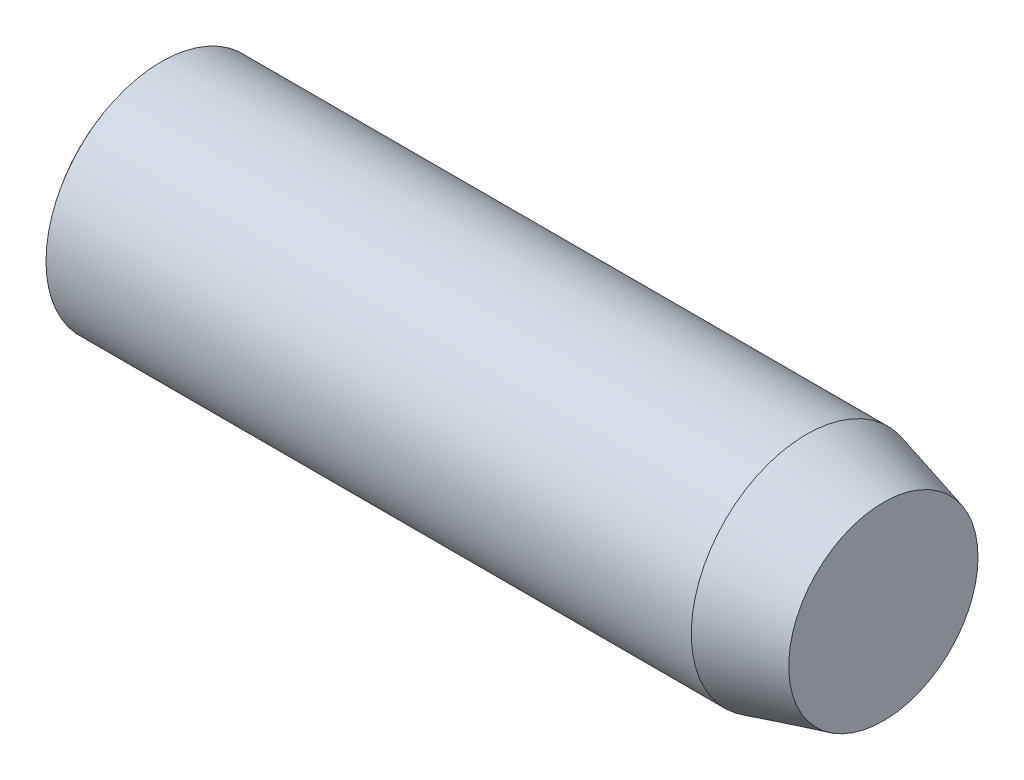
ISO-10303-21;
HEADER;
FILE_DESCRIPTION(('STEP AP214'),'2;1');
FILE_NAME('part.step','',(''),(''),'','','');
FILE_SCHEMA(('AUTOMOTIVE_DESIGN { 1 0 10303 214 1 1 1 1 }'));
ENDSEC;
DATA;
#1=APPLICATION_CONTEXT('core data for automotive mechanical design processes');
#2=APPLICATION_PROTOCOL_DEFINITION('international standard','automotive_design',2000,#1);
#3=PRODUCT_CONTEXT('',#1,'mechanical');
#4=PRODUCT('Part','Part','',(#3));
#5=PRODUCT_RELATED_PRODUCT_CATEGORY('part','',(#4));
#6=PRODUCT_DEFINITION_FORMATION('','',#4);
#7=PRODUCT_DEFINITION_CONTEXT('part definition',#1,'design');
#8=PRODUCT_DEFINITION('design','',#6,#7);
#9=PRODUCT_DEFINITION_SHAPE('','',#8);
#10=(LENGTH_UNIT() NAMED_UNIT(*) SI_UNIT(.MILLI.,.METRE.));
#11=(NAMED_UNIT(*) PLANE_ANGLE_UNIT() SI_UNIT($,.RADIAN.));
#12=(NAMED_UNIT(*) SI_UNIT($,.STERADIAN.) SOLID_ANGLE_UNIT());
#13=UNCERTAINTY_MEASURE_WITH_UNIT(LENGTH_MEASURE(1.E-05),#10,'distance_accuracy_value','');
#14=(GEOMETRIC_REPRESENTATION_CONTEXT(3) GLOBAL_UNCERTAINTY_ASSIGNED_CONTEXT((#13)) GLOBAL_UNIT_ASSIGNED_CONTEXT((#10,
#11,#12)) REPRESENTATION_CONTEXT('',''));
#15=CARTESIAN_POINT('',(0.,0.,0.));
#16=DIRECTION('',(0.,0.,1.));
#17=DIRECTION('',(1.,0.,0.));
#18=AXIS2_PLACEMENT_3D('',#15,#16,#17);
#19=CARTESIAN_POINT('',(-2.0174413911985,0.,-0.3230234435206));
#20=DIRECTION('',(0.,1.,0.));
#21=DIRECTION('',(0.,0.,1.));
#22=AXIS2_PLACEMENT_3D('',#19,#20,#21);
#23=CIRCLE('',#22,3.);
#24=TRIMMED_CURVE('',#23,(PARAMETER_VALUE(-1.46291269329185)),
(PARAMETER_VALUE(1.46291269329185)),.T.,.PARAMETER.);
#25=CARTESIAN_POINT('',(-2.0174413911985,0.,0.));
#26=DIRECTION('',(1.,0.,0.));
#27=AXIS1_PLACEMENT('',#25,#26);
#28=SURFACE_OF_REVOLUTION('',#24,#27);
#29=CARTESIAN_POINT('',(-5.,0.,0.));
#30=VERTEX_POINT('',#29);
#31=VERTEX_LOOP('',#30);
#32=FACE_BOUND('',#31,.T.);
#33=CARTESIAN_POINT('',(-4.4,0.,0.));
#34=DIRECTION('',(1.,0.,0.));
#35=DIRECTION('',(0.,0.,-1.));
#36=AXIS2_PLACEMENT_3D('',#33,#34,#35);
#37=CIRCLE('',#36,1.5);
#38=CARTESIAN_POINT('',(-4.4,0.,-1.5));
#39=VERTEX_POINT('',#38);
#40=EDGE_CURVE('E11',#39,#39,#37,.T.);
#41=ORIENTED_EDGE('',*,*,#40,.F.);
#42=EDGE_LOOP('',(#41));
#43=FACE_BOUND('',#42,.T.);
#44=ADVANCED_FACE('F16',(#32,#43),#28,.T.);
#45=CARTESIAN_POINT('',(5.,0.,0.));
#46=DIRECTION('',(1.,0.,0.));
#47=DIRECTION('',(0.,0.,-1.));
#48=AXIS2_PLACEMENT_3D('',#45,#46,#47);
#49=CYLINDRICAL_SURFACE('',#48,1.5);
#50=CARTESIAN_POINT('',(4.,0.,0.));
#51=DIRECTION('',(1.,0.,0.));
#52=DIRECTION('',(0.,0.,-1.));
#53=AXIS2_PLACEMENT_3D('',#50,#51,#52);
#54=CIRCLE('',#53,1.5);
#55=CARTESIAN_POINT('',(4.,0.,-1.5));
#56=VERTEX_POINT('',#55);
#57=EDGE_CURVE('E26',#56,#56,#54,.T.);
#58=ORIENTED_EDGE('',*,*,#57,.F.);
#59=EDGE_LOOP('',(#58));
#60=FACE_BOUND('',#59,.T.);
#61=ORIENTED_EDGE('',*,*,#40,.T.);
#62=EDGE_LOOP('',(#61));
#63=FACE_BOUND('',#62,.T.);
#64=ADVANCED_FACE('F18',(#60,#63),#49,.T.);
#65=CARTESIAN_POINT('',(4.,0.,0.));
#66=DIRECTION('',(-1.,0.,0.));
#67=DIRECTION('',(0.,0.,1.));
#68=AXIS2_PLACEMENT_3D('',#65,#66,#67);
#69=CONICAL_SURFACE('',#68,1.5,0.26179938779915);
#70=CARTESIAN_POINT('',(5.,0.,0.));
#71=DIRECTION('',(1.,0.,0.));
#72=DIRECTION('',(0.,0.,-1.));
#73=AXIS2_PLACEMENT_3D('',#70,#71,#72);
#74=CIRCLE('',#73,1.23205080756888);
#75=CARTESIAN_POINT('',(5.,0.,-1.23205080756888));
#76=VERTEX_POINT('',#75);
#77=EDGE_CURVE('E49',#76,#76,#74,.T.);
#78=ORIENTED_EDGE('',*,*,#77,.F.);
#79=EDGE_LOOP('',(#78));
#80=FACE_BOUND('',#79,.T.);
#81=ORIENTED_EDGE('',*,*,#57,.T.);
#82=EDGE_LOOP('',(#81));
#83=FACE_BOUND('',#82,.T.);
#84=ADVANCED_FACE('F50',(#80,#83),#69,.T.);
#85=CARTESIAN_POINT('',(5.,1.23205080756888,0.));
#86=DIRECTION('',(-1.,0.,0.));
#87=DIRECTION('',(0.,0.,1.));
#88=AXIS2_PLACEMENT_3D('',#85,#86,#87);
#89=PLANE('',#88);
#90=ORIENTED_EDGE('',*,*,#77,.T.);
#91=EDGE_LOOP('',(#90));
#92=FACE_BOUND('',#91,.T.);
#93=ADVANCED_FACE('F62',(#92),#89,.F.);
#94=CLOSED_SHELL('',(#44,#64,#84,#93));
#95=MANIFOLD_SOLID_BREP('B1',#94);
#96=ADVANCED_BREP_SHAPE_REPRESENTATION('',(#18,#95),#14);
#97=SHAPE_DEFINITION_REPRESENTATION(#9,#96);
ENDSEC;
END-ISO-10303-21;
